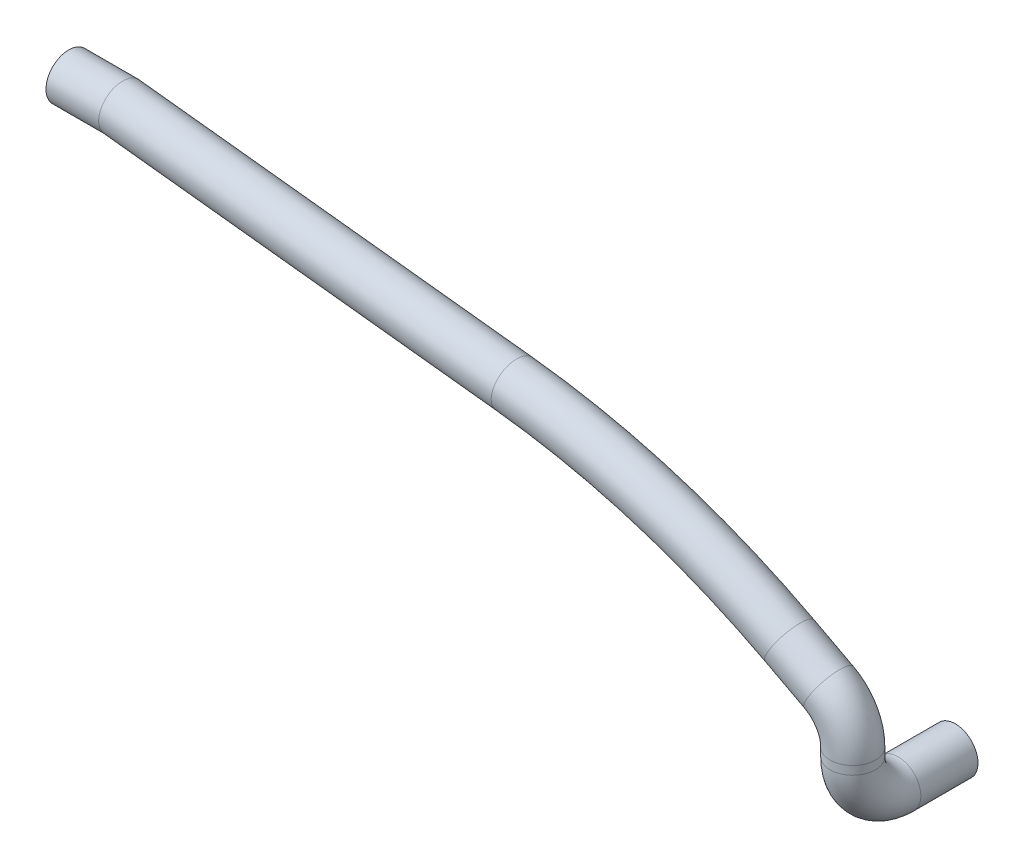
ISO-10303-21;
HEADER;
FILE_DESCRIPTION(('STEP AP214'),'2;1');
FILE_NAME('part.step','',(''),(''),'','','');
FILE_SCHEMA(('AUTOMOTIVE_DESIGN { 1 0 10303 214 1 1 1 1 }'));
ENDSEC;
DATA;
#1=APPLICATION_CONTEXT('core data for automotive mechanical design processes');
#2=APPLICATION_PROTOCOL_DEFINITION('international standard','automotive_design',2000,#1);
#3=PRODUCT_CONTEXT('',#1,'mechanical');
#4=PRODUCT('Part','Part','',(#3));
#5=PRODUCT_RELATED_PRODUCT_CATEGORY('part','',(#4));
#6=PRODUCT_DEFINITION_FORMATION('','',#4);
#7=PRODUCT_DEFINITION_CONTEXT('part definition',#1,'design');
#8=PRODUCT_DEFINITION('design','',#6,#7);
#9=PRODUCT_DEFINITION_SHAPE('','',#8);
#10=(LENGTH_UNIT() NAMED_UNIT(*) SI_UNIT(.MILLI.,.METRE.));
#11=(NAMED_UNIT(*) PLANE_ANGLE_UNIT() SI_UNIT($,.RADIAN.));
#12=(NAMED_UNIT(*) SI_UNIT($,.STERADIAN.) SOLID_ANGLE_UNIT());
#13=UNCERTAINTY_MEASURE_WITH_UNIT(LENGTH_MEASURE(1.E-05),#10,'distance_accuracy_value','');
#14=(GEOMETRIC_REPRESENTATION_CONTEXT(3) GLOBAL_UNCERTAINTY_ASSIGNED_CONTEXT((#13)) GLOBAL_UNIT_ASSIGNED_CONTEXT((#10,
#11,#12)) REPRESENTATION_CONTEXT('',''));
#15=CARTESIAN_POINT('',(0.,0.,0.));
#16=DIRECTION('',(0.,0.,1.));
#17=DIRECTION('',(1.,0.,0.));
#18=AXIS2_PLACEMENT_3D('',#15,#16,#17);
#19=CARTESIAN_POINT('',(0.,0.,0.));
#20=DIRECTION('',(1.,1.78130524173896E-13,0.));
#21=DIRECTION('',(-1.78130524173896E-13,1.,0.));
#22=AXIS2_PLACEMENT_3D('',#19,#20,#21);
#23=PLANE('',#22);
#24=CARTESIAN_POINT('',(0.,0.,0.));
#25=DIRECTION('',(1.,1.78130524173896E-13,0.));
#26=DIRECTION('',(-1.78130524173896E-13,1.,0.));
#27=AXIS2_PLACEMENT_3D('',#24,#25,#26);
#28=CIRCLE('',#27,7.5);
#29=CARTESIAN_POINT('',(-1.33597893130422E-12,7.5,0.));
#30=VERTEX_POINT('',#29);
#31=EDGE_CURVE('E86',#30,#30,#28,.T.);
#32=ORIENTED_EDGE('',*,*,#31,.T.);
#33=EDGE_LOOP('',(#32));
#34=FACE_BOUND('',#33,.T.);
#35=CARTESIAN_POINT('',(0.,0.,0.));
#36=DIRECTION('',(1.,1.78130524173896E-13,0.));
#37=DIRECTION('',(-1.78130524173896E-13,1.,0.));
#38=AXIS2_PLACEMENT_3D('',#35,#36,#37);
#39=CIRCLE('',#38,10.);
#40=CARTESIAN_POINT('',(-1.78130524173896E-12,10.,0.));
#41=VERTEX_POINT('',#40);
#42=EDGE_CURVE('E63',#41,#41,#39,.T.);
#43=ORIENTED_EDGE('',*,*,#42,.F.);
#44=EDGE_LOOP('',(#43));
#45=FACE_BOUND('',#44,.T.);
#46=ADVANCED_FACE('F44',(#34,#45),#23,.F.);
#47=CARTESIAN_POINT('',(344.842449098188,-107.760635274027,-45.9336669885566));
#48=DIRECTION('',(0.,-1.62047113060707E-13,-1.));
#49=DIRECTION('',(0.999997571737116,0.00220375131814484,0.));
#50=AXIS2_PLACEMENT_3D('',#47,#48,#49);
#51=PLANE('',#50);
#52=CARTESIAN_POINT('',(344.842449098188,-107.760635274027,-45.9336669885566));
#53=DIRECTION('',(0.,-1.62047113060707E-13,-1.));
#54=DIRECTION('',(0.999997571737116,0.00220375131814484,0.));
#55=AXIS2_PLACEMENT_3D('',#52,#53,#54);
#56=CIRCLE('',#55,7.5);
#57=CARTESIAN_POINT('',(352.342430886216,-107.744107139141,-45.9336669885566));
#58=VERTEX_POINT('',#57);
#59=EDGE_CURVE('E66',#58,#58,#56,.T.);
#60=ORIENTED_EDGE('',*,*,#59,.F.);
#61=EDGE_LOOP('',(#60));
#62=FACE_BOUND('',#61,.T.);
#63=CARTESIAN_POINT('',(344.842449098188,-107.760635274027,-45.9336669885566));
#64=DIRECTION('',(0.,-1.62047113060707E-13,-1.));
#65=DIRECTION('',(0.,1.,-1.62047113060707E-13));
#66=AXIS2_PLACEMENT_3D('',#63,#64,#65);
#67=CIRCLE('',#66,10.);
#68=CARTESIAN_POINT('',(344.842449098188,-97.760635274027,-45.9336669885582));
#69=VERTEX_POINT('',#68);
#70=EDGE_CURVE('E11',#69,#69,#67,.T.);
#71=ORIENTED_EDGE('',*,*,#70,.T.);
#72=EDGE_LOOP('',(#71));
#73=FACE_BOUND('',#72,.T.);
#74=ADVANCED_FACE('F134',(#62,#73),#51,.T.);
#75=CARTESIAN_POINT('',(23.8033497802133,4.24010317344399E-12,0.));
#76=DIRECTION('',(-1.,-1.78130524173896E-13,0.));
#77=DIRECTION('',(1.78130524173896E-13,-1.,0.));
#78=AXIS2_PLACEMENT_3D('',#75,#76,#77);
#79=CYLINDRICAL_SURFACE('',#78,10.);
#80=CARTESIAN_POINT('',(23.2165755190313,4.39231984117287E-12,0.));
#81=DIRECTION('',(-0.998397196289535,0.0565834527974426,0.00116245890939922));
#82=DIRECTION('',(-0.0565953924025297,-0.998186570163645,-0.0205068940539833));
#83=AXIS2_PLACEMENT_3D('',#80,#81,#82);
#84=ELLIPSE('',#83,10.0160537681439,10.);
#85=CARTESIAN_POINT('',(22.6497130256984,-9.99789035739382,-0.205398153462322));
#86=VERTEX_POINT('',#85);
#87=EDGE_CURVE('E65',#86,#86,#84,.T.);
#88=ORIENTED_EDGE('',*,*,#87,.T.);
#89=EDGE_LOOP('',(#88));
#90=FACE_BOUND('',#89,.T.);
#91=ORIENTED_EDGE('',*,*,#42,.T.);
#92=EDGE_LOOP('',(#91));
#93=FACE_BOUND('',#92,.T.);
#94=ADVANCED_FACE('F131',(#90,#93),#79,.T.);
#95=CARTESIAN_POINT('',(344.842449098188,-107.760635274024,-30.1758312621559));
#96=DIRECTION('',(0.,0.,1.));
#97=DIRECTION('',(0.,-1.,0.));
#98=AXIS2_PLACEMENT_3D('',#95,#96,#97);
#99=CYLINDRICAL_SURFACE('',#98,10.);
#100=CARTESIAN_POINT('',(344.842449098188,-107.760635274025,-20.7513685467059));
#101=DIRECTION('',(0.,0.,1.));
#102=DIRECTION('',(0.,-1.,0.));
#103=AXIS2_PLACEMENT_3D('',#100,#101,#102);
#104=CIRCLE('',#103,10.);
#105=CARTESIAN_POINT('',(344.842449098188,-117.760635274025,-20.7513685467068));
#106=VERTEX_POINT('',#105);
#107=EDGE_CURVE('E51',#106,#106,#104,.F.);
#108=ORIENTED_EDGE('',*,*,#107,.T.);
#109=EDGE_LOOP('',(#108));
#110=FACE_BOUND('',#109,.T.);
#111=ORIENTED_EDGE('',*,*,#70,.F.);
#112=EDGE_LOOP('',(#111));
#113=FACE_BOUND('',#112,.T.);
#114=ADVANCED_FACE('F133',(#110,#113),#99,.T.);
#115=CARTESIAN_POINT('',(344.842449098188,-87.7606352740252,-20.7513685467041));
#116=DIRECTION('',(-1.,0.,0.));
#117=DIRECTION('',(0.,0.,1.));
#118=AXIS2_PLACEMENT_3D('',#115,#116,#117);
#119=TOROIDAL_SURFACE('',#118,20.,10.);
#120=CARTESIAN_POINT('',(344.842449098188,-87.7606352740253,-0.751368546704073));
#121=DIRECTION('',(0.,-1.,0.));
#122=DIRECTION('',(0.,0.,-1.));
#123=AXIS2_PLACEMENT_3D('',#120,#121,#122);
#124=CIRCLE('',#123,10.);
#125=CARTESIAN_POINT('',(344.842449098188,-87.7606352740253,9.24863145329593));
#126=VERTEX_POINT('',#125);
#127=EDGE_CURVE('E55',#126,#126,#124,.T.);
#128=CARTESIAN_POINT('',(344.842449098188,-87.7606352740252,-20.7513685467041));
#129=DIRECTION('',(-1.,0.,0.));
#130=DIRECTION('',(0.,0.,1.));
#131=AXIS2_PLACEMENT_3D('',#128,#129,#130);
#132=CIRCLE('',#131,30.);
#133=EDGE_CURVE('',#106,#126,#132,.T.);
#134=ORIENTED_EDGE('',*,*,#107,.F.);
#135=ORIENTED_EDGE('',*,*,#127,.T.);
#136=ORIENTED_EDGE('',*,*,#133,.T.);
#137=ORIENTED_EDGE('',*,*,#133,.F.);
#138=EDGE_LOOP('',(#134,#136,#135,#137));
#139=FACE_BOUND('',#138,.T.);
#140=ADVANCED_FACE('F114',(#139),#119,.T.);
#141=CARTESIAN_POINT('',(344.842449098188,-87.7606352740253,-0.751368546704073));
#142=DIRECTION('',(0.,1.,0.));
#143=DIRECTION('',(0.,0.,1.));
#144=AXIS2_PLACEMENT_3D('',#141,#142,#143);
#145=CYLINDRICAL_SURFACE('',#144,10.);
#146=CARTESIAN_POINT('',(344.842449098188,-84.0356914758134,-0.751368546704073));
#147=DIRECTION('',(0.,1.,0.));
#148=DIRECTION('',(0.,0.,1.));
#149=AXIS2_PLACEMENT_3D('',#146,#147,#148);
#150=CIRCLE('',#149,10.);
#151=CARTESIAN_POINT('',(354.842421810151,-84.0356914758134,-0.774730053289513));
#152=VERTEX_POINT('',#151);
#153=EDGE_CURVE('E60',#152,#152,#150,.F.);
#154=ORIENTED_EDGE('',*,*,#153,.T.);
#155=EDGE_LOOP('',(#154));
#156=FACE_BOUND('',#155,.T.);
#157=ORIENTED_EDGE('',*,*,#127,.F.);
#158=EDGE_LOOP('',(#157));
#159=FACE_BOUND('',#158,.T.);
#160=ADVANCED_FACE('F99',(#156,#159),#145,.T.);
#161=CARTESIAN_POINT('',(324.842503674261,-84.0356914758132,-0.704645533533194));
#162=DIRECTION('',(0.00233615065854398,0.,0.999997271196327));
#163=DIRECTION('',(0.999997271196327,0.,-0.00233615065854398));
#164=AXIS2_PLACEMENT_3D('',#161,#162,#163);
#165=TOROIDAL_SURFACE('',#164,20.,10.);
#166=CARTESIAN_POINT('',(334.225321639114,-66.3732384592134,-0.726565269715452));
#167=DIRECTION('',(0.883120240961658,-0.469142178439554,-0.00206310756231127));
#168=DIRECTION('',(0.469143176874131,0.883122120429812,0.));
#169=AXIS2_PLACEMENT_3D('',#166,#167,#168);
#170=CIRCLE('',#169,10.);
#171=CARTESIAN_POINT('',(338.916730621541,-57.5420119509135,-0.737525137806582));
#172=VERTEX_POINT('',#171);
#173=EDGE_CURVE('E94',#172,#172,#170,.T.);
#174=CARTESIAN_POINT('',(324.842503674261,-84.0356914758132,-0.704645533533194));
#175=DIRECTION('',(0.00233615065854398,0.,0.999997271196327));
#176=DIRECTION('',(0.999997271196327,0.,-0.00233615065854398));
#177=AXIS2_PLACEMENT_3D('',#174,#175,#176);
#178=CIRCLE('',#177,30.);
#179=EDGE_CURVE('',#152,#172,#178,.T.);
#180=ORIENTED_EDGE('',*,*,#153,.F.);
#181=ORIENTED_EDGE('',*,*,#173,.T.);
#182=ORIENTED_EDGE('',*,*,#179,.T.);
#183=ORIENTED_EDGE('',*,*,#179,.F.);
#184=EDGE_LOOP('',(#180,#182,#181,#183));
#185=FACE_BOUND('',#184,.T.);
#186=ADVANCED_FACE('F102',(#185),#165,.T.);
#187=CARTESIAN_POINT('',(334.225321639114,-66.3732384592134,-0.726565269715457));
#188=DIRECTION('',(-0.883120240961664,0.469142178439542,0.00206310756231183));
#189=DIRECTION('',(-0.469143176874119,-0.883122120429819,0.));
#190=AXIS2_PLACEMENT_3D('',#187,#188,#189);
#191=CYLINDRICAL_SURFACE('',#190,10.);
#192=CARTESIAN_POINT('',(316.942254409594,-57.1919113487117,-0.686189310647484));
#193=DIRECTION('',(-0.883120240961664,0.469142178439542,0.00206310756231183));
#194=DIRECTION('',(-0.469143176874119,-0.883122120429819,0.));
#195=AXIS2_PLACEMENT_3D('',#192,#193,#194);
#196=CIRCLE('',#195,10.);
#197=CARTESIAN_POINT('',(321.633663392021,-48.3606848404117,-0.69714917873859));
#198=VERTEX_POINT('',#197);
#199=EDGE_CURVE('E91',#198,#198,#196,.F.);
#200=ORIENTED_EDGE('',*,*,#199,.T.);
#201=EDGE_LOOP('',(#200));
#202=FACE_BOUND('',#201,.T.);
#203=ORIENTED_EDGE('',*,*,#173,.F.);
#204=EDGE_LOOP('',(#203));
#205=FACE_BOUND('',#204,.T.);
#206=ADVANCED_FACE('F104',(#202,#205),#191,.T.);
#207=CARTESIAN_POINT('',(157.434349007096,-357.453612630911,-0.31355379554987));
#208=DIRECTION('',(0.00233615065854463,0.,0.999997271196327));
#209=DIRECTION('',(0.999997271196327,0.,-0.00233615065854463));
#210=AXIS2_PLACEMENT_3D('',#207,#208,#209);
#211=TOROIDAL_SURFACE('',#210,340.,10.);
#212=CARTESIAN_POINT('',(195.849321407909,-19.6307569186819,-0.403297203513373));
#213=DIRECTION('',(0.993593923117587,-0.112985521258874,-0.00232119143189306));
#214=DIRECTION('',(0.112985825639124,0.993596599835489,0.));
#215=AXIS2_PLACEMENT_3D('',#212,#213,#214);
#216=CIRCLE('',#215,10.);
#217=CARTESIAN_POINT('',(196.979173537345,-9.69479057420464,-0.4059367155123));
#218=VERTEX_POINT('',#217);
#219=EDGE_CURVE('E70',#218,#218,#216,.T.);
#220=CARTESIAN_POINT('',(157.434349007096,-357.453612630911,-0.31355379554987));
#221=DIRECTION('',(0.00233615065854463,0.,0.999997271196327));
#222=DIRECTION('',(0.999997271196327,0.,-0.00233615065854463));
#223=AXIS2_PLACEMENT_3D('',#220,#221,#222);
#224=CIRCLE('',#223,350.);
#225=EDGE_CURVE('',#198,#218,#224,.T.);
#226=ORIENTED_EDGE('',*,*,#199,.F.);
#227=ORIENTED_EDGE('',*,*,#219,.T.);
#228=ORIENTED_EDGE('',*,*,#225,.T.);
#229=ORIENTED_EDGE('',*,*,#225,.F.);
#230=EDGE_LOOP('',(#226,#228,#227,#229));
#231=FACE_BOUND('',#230,.T.);
#232=ADVANCED_FACE('F111',(#231),#211,.T.);
#233=CARTESIAN_POINT('',(195.849321407909,-19.6307569186818,-0.403297203513398));
#234=DIRECTION('',(-0.993593923117587,0.112985521258873,0.00232119143189192));
#235=DIRECTION('',(-0.112985825639124,-0.993596599835489,0.));
#236=AXIS2_PLACEMENT_3D('',#233,#234,#235);
#237=CYLINDRICAL_SURFACE('',#236,10.);
#238=ORIENTED_EDGE('',*,*,#219,.F.);
#239=EDGE_LOOP('',(#238));
#240=FACE_BOUND('',#239,.T.);
#241=ORIENTED_EDGE('',*,*,#87,.F.);
#242=EDGE_LOOP('',(#241));
#243=FACE_BOUND('',#242,.T.);
#244=ADVANCED_FACE('F46',(#240,#243),#237,.T.);
#245=CARTESIAN_POINT('',(23.8033497802133,4.24010317344399E-12,0.));
#246=DIRECTION('',(-1.,-1.78130524173896E-13,0.));
#247=DIRECTION('',(1.78130524173896E-13,-1.,0.));
#248=AXIS2_PLACEMENT_3D('',#245,#246,#247);
#249=CYLINDRICAL_SURFACE('',#248,7.5);
#250=CARTESIAN_POINT('',(23.2165755190358,4.13558076672871E-12,0.));
#251=DIRECTION('',(-0.998397196289535,0.0565834527974426,0.00116245890939922));
#252=DIRECTION('',(0.056595392402531,0.998186570163646,0.0205068940539833));
#253=AXIS2_PLACEMENT_3D('',#250,#251,#252);
#254=ELLIPSE('',#253,7.51204032610792,7.5);
#255=CARTESIAN_POINT('',(23.6417223890355,7.4984177680528,0.154048615096746));
#256=VERTEX_POINT('',#255);
#257=EDGE_CURVE('E82',#256,#256,#254,.T.);
#258=ORIENTED_EDGE('',*,*,#257,.F.);
#259=EDGE_LOOP('',(#258));
#260=FACE_BOUND('',#259,.T.);
#261=ORIENTED_EDGE('',*,*,#31,.F.);
#262=EDGE_LOOP('',(#261));
#263=FACE_BOUND('',#262,.T.);
#264=ADVANCED_FACE('F117',(#260,#263),#249,.F.);
#265=CARTESIAN_POINT('',(344.842449098188,-107.760635274027,-45.9336669885566));
#266=DIRECTION('',(0.,1.62047187251717E-13,1.));
#267=DIRECTION('',(0.,-1.,1.62047187251717E-13));
#268=AXIS2_PLACEMENT_3D('',#265,#266,#267);
#269=CYLINDRICAL_SURFACE('',#268,7.5);
#270=ORIENTED_EDGE('',*,*,#59,.T.);
#271=EDGE_LOOP('',(#270));
#272=FACE_BOUND('',#271,.T.);
#273=CARTESIAN_POINT('',(344.842449098188,-107.760635274025,-20.7513685467059));
#274=DIRECTION('',(0.,0.,-1.));
#275=DIRECTION('',(0.999997571737116,0.00220375131814484,0.));
#276=AXIS2_PLACEMENT_3D('',#273,#274,#275);
#277=CIRCLE('',#276,7.5);
#278=CARTESIAN_POINT('',(344.842449098188,-115.260635274025,-20.7513685467066));
#279=VERTEX_POINT('',#278);
#280=EDGE_CURVE('E73',#279,#279,#277,.T.);
#281=ORIENTED_EDGE('',*,*,#280,.F.);
#282=EDGE_LOOP('',(#281));
#283=FACE_BOUND('',#282,.T.);
#284=ADVANCED_FACE('F123',(#272,#283),#269,.F.);
#285=CARTESIAN_POINT('',(344.842449098188,-87.7606352740252,-20.7513685467041));
#286=DIRECTION('',(-1.,0.,0.));
#287=DIRECTION('',(0.,0.,1.));
#288=AXIS2_PLACEMENT_3D('',#285,#286,#287);
#289=TOROIDAL_SURFACE('',#288,20.,7.5);
#290=CARTESIAN_POINT('',(344.842449098188,-87.7606352740253,-0.751368546704073));
#291=DIRECTION('',(0.,-1.,0.));
#292=DIRECTION('',(0.999997571737116,0.,-0.00220375131814484));
#293=AXIS2_PLACEMENT_3D('',#290,#291,#292);
#294=CIRCLE('',#293,7.5);
#295=CARTESIAN_POINT('',(344.842449098188,-87.7606352740253,6.74863145329593));
#296=VERTEX_POINT('',#295);
#297=EDGE_CURVE('E78',#296,#296,#294,.T.);
#298=CARTESIAN_POINT('',(344.842449098188,-87.7606352740252,-20.7513685467041));
#299=DIRECTION('',(-1.,0.,0.));
#300=DIRECTION('',(0.,0.,1.));
#301=AXIS2_PLACEMENT_3D('',#298,#299,#300);
#302=CIRCLE('',#301,27.5);
#303=EDGE_CURVE('',#279,#296,#302,.T.);
#304=ORIENTED_EDGE('',*,*,#280,.T.);
#305=ORIENTED_EDGE('',*,*,#297,.F.);
#306=ORIENTED_EDGE('',*,*,#303,.T.);
#307=ORIENTED_EDGE('',*,*,#303,.F.);
#308=EDGE_LOOP('',(#304,#306,#305,#307));
#309=FACE_BOUND('',#308,.T.);
#310=ADVANCED_FACE('F193',(#309),#289,.F.);
#311=CARTESIAN_POINT('',(344.842449098188,-87.7606352740253,-0.751368546704073));
#312=DIRECTION('',(0.,1.,0.));
#313=DIRECTION('',(0.,0.,1.));
#314=AXIS2_PLACEMENT_3D('',#311,#312,#313);
#315=CYLINDRICAL_SURFACE('',#314,7.5);
#316=CARTESIAN_POINT('',(344.842449098188,-84.0356914758134,-0.751368546704073));
#317=DIRECTION('',(0.,-1.,0.));
#318=DIRECTION('',(0.999997571737116,0.,-0.00220375131814484));
#319=AXIS2_PLACEMENT_3D('',#316,#317,#318);
#320=CIRCLE('',#319,7.5);
#321=CARTESIAN_POINT('',(352.34242863216,-84.0356914758134,-0.768889676643153));
#322=VERTEX_POINT('',#321);
#323=EDGE_CURVE('E298',#322,#322,#320,.T.);
#324=ORIENTED_EDGE('',*,*,#323,.F.);
#325=EDGE_LOOP('',(#324));
#326=FACE_BOUND('',#325,.T.);
#327=ORIENTED_EDGE('',*,*,#297,.T.);
#328=EDGE_LOOP('',(#327));
#329=FACE_BOUND('',#328,.T.);
#330=ADVANCED_FACE('F202',(#326,#329),#315,.F.);
#331=CARTESIAN_POINT('',(324.842503674261,-84.0356914758132,-0.704645533533194));
#332=DIRECTION('',(0.00233615065854398,0.,0.999997271196327));
#333=DIRECTION('',(0.999997271196327,0.,-0.00233615065854398));
#334=AXIS2_PLACEMENT_3D('',#331,#332,#333);
#335=TOROIDAL_SURFACE('',#334,20.,7.5);
#336=CARTESIAN_POINT('',(334.225321639114,-66.3732384592134,-0.726565269715452));
#337=DIRECTION('',(0.88312024096166,-0.469142178439549,-0.00206310756231127));
#338=DIRECTION('',(0.469141203436308,0.883122643089567,-0.000963587479583615));
#339=AXIS2_PLACEMENT_3D('',#336,#337,#338);
#340=CIRCLE('',#339,7.5);
#341=CARTESIAN_POINT('',(337.743878375934,-59.7498185779885,-0.734785170783799));
#342=VERTEX_POINT('',#341);
#343=EDGE_CURVE('E293',#342,#342,#340,.T.);
#344=CARTESIAN_POINT('',(324.842503674261,-84.0356914758132,-0.704645533533194));
#345=DIRECTION('',(0.00233615065854398,0.,0.999997271196327));
#346=DIRECTION('',(0.999997271196327,0.,-0.00233615065854398));
#347=AXIS2_PLACEMENT_3D('',#344,#345,#346);
#348=CIRCLE('',#347,27.5);
#349=EDGE_CURVE('',#322,#342,#348,.T.);
#350=ORIENTED_EDGE('',*,*,#323,.T.);
#351=ORIENTED_EDGE('',*,*,#343,.F.);
#352=ORIENTED_EDGE('',*,*,#349,.T.);
#353=ORIENTED_EDGE('',*,*,#349,.F.);
#354=EDGE_LOOP('',(#350,#352,#351,#353));
#355=FACE_BOUND('',#354,.T.);
#356=ADVANCED_FACE('F212',(#355),#335,.F.);
#357=CARTESIAN_POINT('',(334.225321639114,-66.3732384592134,-0.726565269715457));
#358=DIRECTION('',(-0.883120240961664,0.469142178439542,0.00206310756231183));
#359=DIRECTION('',(-0.469143176874119,-0.883122120429819,0.));
#360=AXIS2_PLACEMENT_3D('',#357,#358,#359);
#361=CYLINDRICAL_SURFACE('',#360,7.5);
#362=CARTESIAN_POINT('',(316.942254409594,-57.1919113487117,-0.686189310647484));
#363=DIRECTION('',(0.883120240961664,-0.469142178439541,-0.00206310756231183));
#364=DIRECTION('',(0.469141203436301,0.883122643089571,-0.000963587479583599));
#365=AXIS2_PLACEMENT_3D('',#362,#363,#364);
#366=CIRCLE('',#365,7.5);
#367=CARTESIAN_POINT('',(320.460811146414,-50.5684914674868,-0.694409211715814));
#368=VERTEX_POINT('',#367);
#369=EDGE_CURVE('E290',#368,#368,#366,.T.);
#370=ORIENTED_EDGE('',*,*,#369,.F.);
#371=EDGE_LOOP('',(#370));
#372=FACE_BOUND('',#371,.T.);
#373=ORIENTED_EDGE('',*,*,#343,.T.);
#374=EDGE_LOOP('',(#373));
#375=FACE_BOUND('',#374,.T.);
#376=ADVANCED_FACE('F222',(#372,#375),#361,.F.);
#377=CARTESIAN_POINT('',(157.434349007096,-357.453612630911,-0.31355379554987));
#378=DIRECTION('',(0.00233615065854463,0.,0.999997271196327));
#379=DIRECTION('',(0.999997271196327,0.,-0.00233615065854463));
#380=AXIS2_PLACEMENT_3D('',#377,#378,#379);
#381=TOROIDAL_SURFACE('',#380,340.,7.5);
#382=CARTESIAN_POINT('',(195.849321407909,-19.6307569186818,-0.403297203513373));
#383=DIRECTION('',(0.993593923117587,-0.112985521258873,-0.00232119143189306));
#384=DIRECTION('',(0.112985521258873,0.993596625739019,-0.000131551877658331));
#385=AXIS2_PLACEMENT_3D('',#382,#383,#384);
#386=CIRCLE('',#385,7.5);
#387=CARTESIAN_POINT('',(196.696710504986,-12.1787821603239,-0.405276837512568));
#388=VERTEX_POINT('',#387);
#389=EDGE_CURVE('E85',#388,#388,#386,.T.);
#390=CARTESIAN_POINT('',(157.434349007096,-357.453612630911,-0.31355379554987));
#391=DIRECTION('',(0.00233615065854463,0.,0.999997271196327));
#392=DIRECTION('',(0.999997271196327,0.,-0.00233615065854463));
#393=AXIS2_PLACEMENT_3D('',#390,#391,#392);
#394=CIRCLE('',#393,347.5);
#395=EDGE_CURVE('',#368,#388,#394,.T.);
#396=ORIENTED_EDGE('',*,*,#369,.T.);
#397=ORIENTED_EDGE('',*,*,#389,.F.);
#398=ORIENTED_EDGE('',*,*,#395,.T.);
#399=ORIENTED_EDGE('',*,*,#395,.F.);
#400=EDGE_LOOP('',(#396,#398,#397,#399));
#401=FACE_BOUND('',#400,.T.);
#402=ADVANCED_FACE('F232',(#401),#381,.F.);
#403=CARTESIAN_POINT('',(195.849321407909,-19.6307569186818,-0.403297203513398));
#404=DIRECTION('',(-0.993593923117587,0.112985521258873,0.00232119143189192));
#405=DIRECTION('',(-0.112985825639124,-0.993596599835489,0.));
#406=AXIS2_PLACEMENT_3D('',#403,#404,#405);
#407=CYLINDRICAL_SURFACE('',#406,7.5);
#408=ORIENTED_EDGE('',*,*,#389,.T.);
#409=EDGE_LOOP('',(#408));
#410=FACE_BOUND('',#409,.T.);
#411=ORIENTED_EDGE('',*,*,#257,.T.);
#412=EDGE_LOOP('',(#411));
#413=FACE_BOUND('',#412,.T.);
#414=ADVANCED_FACE('F242',(#410,#413),#407,.F.);
#415=CLOSED_SHELL('',(#46,#74,#94,#114,#140,#160,#186,#206,#232,#244,#264,#284,#310,#330,#356,
#376,#402,#414));
#416=MANIFOLD_SOLID_BREP('B2',#415);
#417=ADVANCED_BREP_SHAPE_REPRESENTATION('',(#18,#416),#14);
#418=SHAPE_DEFINITION_REPRESENTATION(#9,#417);
ENDSEC;
END-ISO-10303-21;
